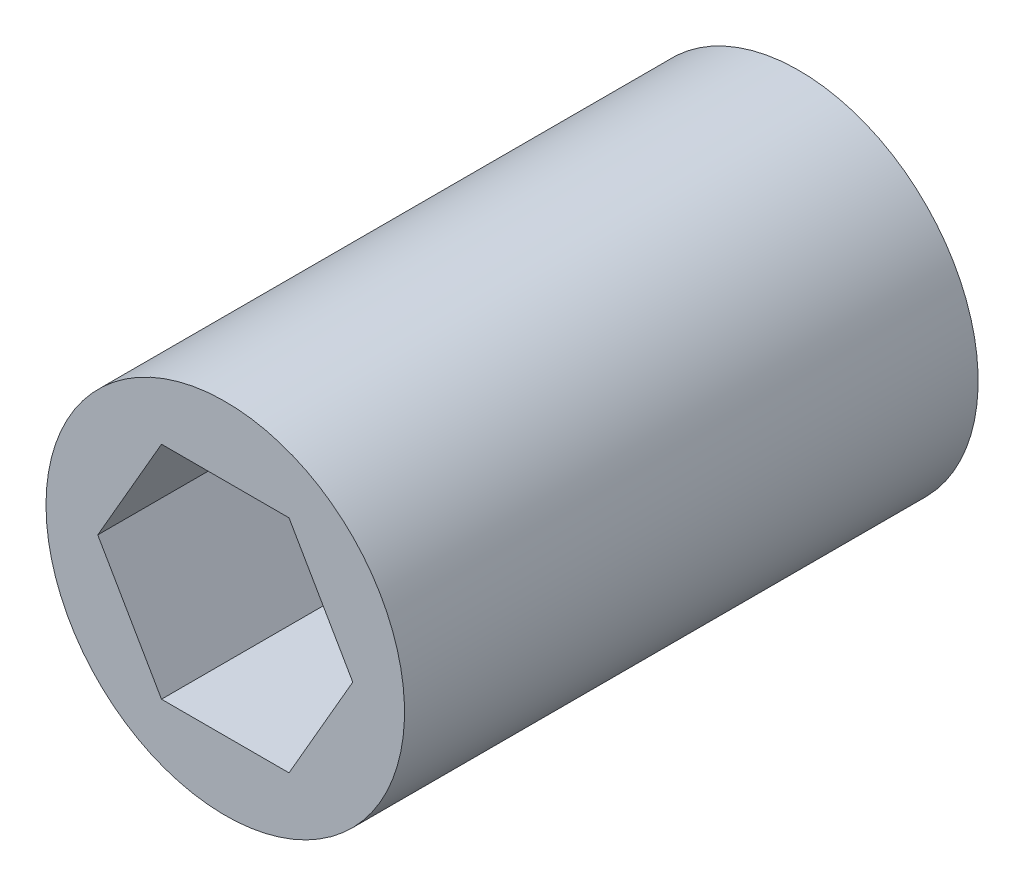
ISO-10303-21;
HEADER;
FILE_DESCRIPTION(('STEP AP214'),'2;1');
FILE_NAME('part.step','',(''),(''),'','','');
FILE_SCHEMA(('AUTOMOTIVE_DESIGN { 1 0 10303 214 1 1 1 1 }'));
ENDSEC;
DATA;
#1=APPLICATION_CONTEXT('core data for automotive mechanical design processes');
#2=APPLICATION_PROTOCOL_DEFINITION('international standard','automotive_design',2000,#1);
#3=PRODUCT_CONTEXT('',#1,'mechanical');
#4=PRODUCT('Part','Part','',(#3));
#5=PRODUCT_RELATED_PRODUCT_CATEGORY('part','',(#4));
#6=PRODUCT_DEFINITION_FORMATION('','',#4);
#7=PRODUCT_DEFINITION_CONTEXT('part definition',#1,'design');
#8=PRODUCT_DEFINITION('design','',#6,#7);
#9=PRODUCT_DEFINITION_SHAPE('','',#8);
#10=(LENGTH_UNIT() NAMED_UNIT(*) SI_UNIT(.MILLI.,.METRE.));
#11=(NAMED_UNIT(*) PLANE_ANGLE_UNIT() SI_UNIT($,.RADIAN.));
#12=(NAMED_UNIT(*) SI_UNIT($,.STERADIAN.) SOLID_ANGLE_UNIT());
#13=UNCERTAINTY_MEASURE_WITH_UNIT(LENGTH_MEASURE(1.E-05),#10,'distance_accuracy_value','');
#14=(GEOMETRIC_REPRESENTATION_CONTEXT(3) GLOBAL_UNCERTAINTY_ASSIGNED_CONTEXT((#13)) GLOBAL_UNIT_ASSIGNED_CONTEXT((#10,
#11,#12)) REPRESENTATION_CONTEXT('',''));
#15=CARTESIAN_POINT('',(0.,0.,0.));
#16=DIRECTION('',(0.,0.,1.));
#17=DIRECTION('',(1.,0.,0.));
#18=AXIS2_PLACEMENT_3D('',#15,#16,#17);
#19=CARTESIAN_POINT('',(-5.64590828240535,0.,12.7));
#20=DIRECTION('',(0.866025403784439,0.5,0.));
#21=DIRECTION('',(-0.5,0.866025403784439,0.));
#22=AXIS2_PLACEMENT_3D('',#19,#20,#21);
#23=PLANE('',#22);
#24=DIRECTION('',(-0.5,0.866025403784439,0.));
#25=VECTOR('',#24,1.);
#26=CARTESIAN_POINT('',(-2.82295414120268,-4.8895,12.7));
#27=LINE('',#26,#25);
#28=CARTESIAN_POINT('',(-2.82295414120268,-4.8895,12.7));
#29=VERTEX_POINT('',#28);
#30=CARTESIAN_POINT('',(-5.64590828240535,0.,12.7));
#31=VERTEX_POINT('',#30);
#32=EDGE_CURVE('E82',#29,#31,#27,.T.);
#33=ORIENTED_EDGE('',*,*,#32,.F.);
#34=DIRECTION('',(0.,0.,1.));
#35=VECTOR('',#34,1.);
#36=CARTESIAN_POINT('',(-2.82295414120268,-4.8895,12.7));
#37=LINE('',#36,#35);
#38=CARTESIAN_POINT('',(-2.82295414120268,-4.8895,-12.7));
#39=VERTEX_POINT('',#38);
#40=EDGE_CURVE('E74',#39,#29,#37,.T.);
#41=ORIENTED_EDGE('',*,*,#40,.F.);
#42=DIRECTION('',(-0.5,0.866025403784439,0.));
#43=VECTOR('',#42,1.);
#44=CARTESIAN_POINT('',(-2.82295414120268,-4.8895,-12.7));
#45=LINE('',#44,#43);
#46=CARTESIAN_POINT('',(-5.64590828240535,0.,-12.7));
#47=VERTEX_POINT('',#46);
#48=EDGE_CURVE('E114',#39,#47,#45,.T.);
#49=ORIENTED_EDGE('',*,*,#48,.T.);
#50=DIRECTION('',(0.,0.,1.));
#51=VECTOR('',#50,1.);
#52=CARTESIAN_POINT('',(-5.64590828240535,0.,12.7));
#53=LINE('',#52,#51);
#54=EDGE_CURVE('E99',#31,#47,#53,.F.);
#55=ORIENTED_EDGE('',*,*,#54,.F.);
#56=EDGE_LOOP('',(#33,#41,#49,#55));
#57=FACE_BOUND('',#56,.T.);
#58=ADVANCED_FACE('F15',(#57),#23,.T.);
#59=CARTESIAN_POINT('',(-2.82295414120268,4.8895,12.7));
#60=DIRECTION('',(0.866025403784439,-0.5,0.));
#61=DIRECTION('',(0.5,0.866025403784439,0.));
#62=AXIS2_PLACEMENT_3D('',#59,#60,#61);
#63=PLANE('',#62);
#64=DIRECTION('',(0.5,0.866025403784439,0.));
#65=VECTOR('',#64,1.);
#66=CARTESIAN_POINT('',(-5.64590828240535,0.,12.7));
#67=LINE('',#66,#65);
#68=CARTESIAN_POINT('',(-2.82295414120268,4.8895,12.7));
#69=VERTEX_POINT('',#68);
#70=EDGE_CURVE('E107',#31,#69,#67,.T.);
#71=ORIENTED_EDGE('',*,*,#70,.F.);
#72=ORIENTED_EDGE('',*,*,#54,.T.);
#73=DIRECTION('',(0.5,0.866025403784439,0.));
#74=VECTOR('',#73,1.);
#75=CARTESIAN_POINT('',(-5.64590828240535,0.,-12.7));
#76=LINE('',#75,#74);
#77=CARTESIAN_POINT('',(-2.82295414120268,4.8895,-12.7));
#78=VERTEX_POINT('',#77);
#79=EDGE_CURVE('E105',#47,#78,#76,.T.);
#80=ORIENTED_EDGE('',*,*,#79,.T.);
#81=DIRECTION('',(0.,0.,1.));
#82=VECTOR('',#81,1.);
#83=CARTESIAN_POINT('',(-2.82295414120268,4.8895,12.7));
#84=LINE('',#83,#82);
#85=EDGE_CURVE('E96',#69,#78,#84,.F.);
#86=ORIENTED_EDGE('',*,*,#85,.F.);
#87=EDGE_LOOP('',(#71,#72,#80,#86));
#88=FACE_BOUND('',#87,.T.);
#89=ADVANCED_FACE('F104',(#88),#63,.T.);
#90=CARTESIAN_POINT('',(2.82295414120267,4.8895,12.7));
#91=DIRECTION('',(0.,-1.,0.));
#92=DIRECTION('',(1.,0.,0.));
#93=AXIS2_PLACEMENT_3D('',#90,#91,#92);
#94=PLANE('',#93);
#95=DIRECTION('',(1.,0.,0.));
#96=VECTOR('',#95,1.);
#97=CARTESIAN_POINT('',(0.,4.8895,12.7));
#98=LINE('',#97,#96);
#99=CARTESIAN_POINT('',(2.82295414120267,4.8895,12.7));
#100=VERTEX_POINT('',#99);
#101=EDGE_CURVE('E124',#69,#100,#98,.T.);
#102=ORIENTED_EDGE('',*,*,#101,.F.);
#103=ORIENTED_EDGE('',*,*,#85,.T.);
#104=DIRECTION('',(1.,0.,0.));
#105=VECTOR('',#104,1.);
#106=CARTESIAN_POINT('',(0.,4.8895,-12.7));
#107=LINE('',#106,#105);
#108=CARTESIAN_POINT('',(2.82295414120267,4.8895,-12.7));
#109=VERTEX_POINT('',#108);
#110=EDGE_CURVE('E116',#78,#109,#107,.T.);
#111=ORIENTED_EDGE('',*,*,#110,.T.);
#112=DIRECTION('',(0.,0.,1.));
#113=VECTOR('',#112,1.);
#114=CARTESIAN_POINT('',(2.82295414120267,4.8895,12.7));
#115=LINE('',#114,#113);
#116=EDGE_CURVE('E93',#100,#109,#115,.F.);
#117=ORIENTED_EDGE('',*,*,#116,.F.);
#118=EDGE_LOOP('',(#102,#103,#111,#117));
#119=FACE_BOUND('',#118,.T.);
#120=ADVANCED_FACE('F133',(#119),#94,.T.);
#121=CARTESIAN_POINT('',(5.64590828240535,0.,12.7));
#122=DIRECTION('',(-0.866025403784438,-0.500000000000001,0.));
#123=DIRECTION('',(0.500000000000001,-0.866025403784438,0.));
#124=AXIS2_PLACEMENT_3D('',#121,#122,#123);
#125=PLANE('',#124);
#126=DIRECTION('',(0.5,-0.866025403784438,0.));
#127=VECTOR('',#126,1.);
#128=CARTESIAN_POINT('',(2.82295414120267,4.8895,12.7));
#129=LINE('',#128,#127);
#130=CARTESIAN_POINT('',(5.64590828240535,0.,12.7));
#131=VERTEX_POINT('',#130);
#132=EDGE_CURVE('E87',#100,#131,#129,.T.);
#133=ORIENTED_EDGE('',*,*,#132,.F.);
#134=ORIENTED_EDGE('',*,*,#116,.T.);
#135=DIRECTION('',(0.5,-0.866025403784438,0.));
#136=VECTOR('',#135,1.);
#137=CARTESIAN_POINT('',(2.82295414120267,4.8895,-12.7));
#138=LINE('',#137,#136);
#139=CARTESIAN_POINT('',(5.64590828240535,0.,-12.7));
#140=VERTEX_POINT('',#139);
#141=EDGE_CURVE('E118',#109,#140,#138,.T.);
#142=ORIENTED_EDGE('',*,*,#141,.T.);
#143=DIRECTION('',(0.,0.,1.));
#144=VECTOR('',#143,1.);
#145=CARTESIAN_POINT('',(5.64590828240535,0.,12.7));
#146=LINE('',#145,#144);
#147=EDGE_CURVE('E63',#131,#140,#146,.F.);
#148=ORIENTED_EDGE('',*,*,#147,.F.);
#149=EDGE_LOOP('',(#133,#134,#142,#148));
#150=FACE_BOUND('',#149,.T.);
#151=ADVANCED_FACE('F130',(#150),#125,.T.);
#152=CARTESIAN_POINT('',(2.82295414120268,-4.8895,12.7));
#153=DIRECTION('',(-0.866025403784439,0.5,0.));
#154=DIRECTION('',(-0.5,-0.866025403784439,0.));
#155=AXIS2_PLACEMENT_3D('',#152,#153,#154);
#156=PLANE('',#155);
#157=DIRECTION('',(-0.5,-0.866025403784439,0.));
#158=VECTOR('',#157,1.);
#159=CARTESIAN_POINT('',(5.64590828240535,0.,12.7));
#160=LINE('',#159,#158);
#161=CARTESIAN_POINT('',(2.82295414120268,-4.8895,12.7));
#162=VERTEX_POINT('',#161);
#163=EDGE_CURVE('E69',#131,#162,#160,.T.);
#164=ORIENTED_EDGE('',*,*,#163,.F.);
#165=ORIENTED_EDGE('',*,*,#147,.T.);
#166=DIRECTION('',(-0.5,-0.866025403784439,0.));
#167=VECTOR('',#166,1.);
#168=CARTESIAN_POINT('',(5.64590828240535,0.,-12.7));
#169=LINE('',#168,#167);
#170=CARTESIAN_POINT('',(2.82295414120268,-4.8895,-12.7));
#171=VERTEX_POINT('',#170);
#172=EDGE_CURVE('E31',#140,#171,#169,.T.);
#173=ORIENTED_EDGE('',*,*,#172,.T.);
#174=DIRECTION('',(0.,0.,1.));
#175=VECTOR('',#174,1.);
#176=CARTESIAN_POINT('',(2.82295414120268,-4.8895,12.7));
#177=LINE('',#176,#175);
#178=EDGE_CURVE('E65',#162,#171,#177,.F.);
#179=ORIENTED_EDGE('',*,*,#178,.F.);
#180=EDGE_LOOP('',(#164,#165,#173,#179));
#181=FACE_BOUND('',#180,.T.);
#182=ADVANCED_FACE('F67',(#181),#156,.T.);
#183=CARTESIAN_POINT('',(-2.82295414120268,-4.8895,12.7));
#184=DIRECTION('',(0.,1.,0.));
#185=DIRECTION('',(-1.,0.,0.));
#186=AXIS2_PLACEMENT_3D('',#183,#184,#185);
#187=PLANE('',#186);
#188=DIRECTION('',(1.,0.,0.));
#189=VECTOR('',#188,1.);
#190=CARTESIAN_POINT('',(0.,-4.8895,12.7));
#191=LINE('',#190,#189);
#192=EDGE_CURVE('E77',#162,#29,#191,.F.);
#193=ORIENTED_EDGE('',*,*,#192,.F.);
#194=ORIENTED_EDGE('',*,*,#178,.T.);
#195=DIRECTION('',(1.,0.,0.));
#196=VECTOR('',#195,1.);
#197=CARTESIAN_POINT('',(0.,-4.8895,-12.7));
#198=LINE('',#197,#196);
#199=EDGE_CURVE('E126',#171,#39,#198,.F.);
#200=ORIENTED_EDGE('',*,*,#199,.T.);
#201=ORIENTED_EDGE('',*,*,#40,.T.);
#202=EDGE_LOOP('',(#193,#194,#200,#201));
#203=FACE_BOUND('',#202,.T.);
#204=ADVANCED_FACE('F78',(#203),#187,.T.);
#205=CARTESIAN_POINT('',(0.,0.,12.7));
#206=DIRECTION('',(0.,0.,1.));
#207=DIRECTION('',(1.,0.,0.));
#208=AXIS2_PLACEMENT_3D('',#205,#206,#207);
#209=PLANE('',#208);
#210=ORIENTED_EDGE('',*,*,#101,.T.);
#211=ORIENTED_EDGE('',*,*,#132,.T.);
#212=ORIENTED_EDGE('',*,*,#163,.T.);
#213=ORIENTED_EDGE('',*,*,#192,.T.);
#214=ORIENTED_EDGE('',*,*,#32,.T.);
#215=ORIENTED_EDGE('',*,*,#70,.T.);
#216=EDGE_LOOP('',(#210,#211,#212,#213,#214,#215));
#217=FACE_BOUND('',#216,.T.);
#218=CARTESIAN_POINT('',(0.,0.,12.7));
#219=DIRECTION('',(0.,0.,-1.));
#220=DIRECTION('',(-1.,0.,0.));
#221=AXIS2_PLACEMENT_3D('',#218,#219,#220);
#222=CIRCLE('',#221,7.9375);
#223=CARTESIAN_POINT('',(-7.9375,0.,12.7));
#224=VERTEX_POINT('',#223);
#225=EDGE_CURVE('E18',#224,#224,#222,.T.);
#226=ORIENTED_EDGE('',*,*,#225,.F.);
#227=EDGE_LOOP('',(#226));
#228=FACE_BOUND('',#227,.T.);
#229=ADVANCED_FACE('F85',(#217,#228),#209,.T.);
#230=CARTESIAN_POINT('',(0.,0.,-12.7));
#231=DIRECTION('',(0.,0.,1.));
#232=DIRECTION('',(1.,0.,0.));
#233=AXIS2_PLACEMENT_3D('',#230,#231,#232);
#234=PLANE('',#233);
#235=ORIENTED_EDGE('',*,*,#172,.F.);
#236=ORIENTED_EDGE('',*,*,#141,.F.);
#237=ORIENTED_EDGE('',*,*,#110,.F.);
#238=ORIENTED_EDGE('',*,*,#79,.F.);
#239=ORIENTED_EDGE('',*,*,#48,.F.);
#240=ORIENTED_EDGE('',*,*,#199,.F.);
#241=EDGE_LOOP('',(#235,#236,#237,#238,#239,#240));
#242=FACE_BOUND('',#241,.T.);
#243=CARTESIAN_POINT('',(0.,0.,-12.7));
#244=DIRECTION('',(0.,0.,-1.));
#245=DIRECTION('',(-1.,0.,0.));
#246=AXIS2_PLACEMENT_3D('',#243,#244,#245);
#247=CIRCLE('',#246,7.9375);
#248=CARTESIAN_POINT('',(-7.9375,0.,-12.7));
#249=VERTEX_POINT('',#248);
#250=EDGE_CURVE('E10',#249,#249,#247,.F.);
#251=ORIENTED_EDGE('',*,*,#250,.F.);
#252=EDGE_LOOP('',(#251));
#253=FACE_BOUND('',#252,.T.);
#254=ADVANCED_FACE('F112',(#242,#253),#234,.F.);
#255=CARTESIAN_POINT('',(0.,0.,12.7));
#256=DIRECTION('',(0.,0.,-1.));
#257=DIRECTION('',(-1.,0.,0.));
#258=AXIS2_PLACEMENT_3D('',#255,#256,#257);
#259=CYLINDRICAL_SURFACE('',#258,7.9375);
#260=ORIENTED_EDGE('',*,*,#250,.T.);
#261=EDGE_LOOP('',(#260));
#262=FACE_BOUND('',#261,.T.);
#263=ORIENTED_EDGE('',*,*,#225,.T.);
#264=EDGE_LOOP('',(#263));
#265=FACE_BOUND('',#264,.T.);
#266=ADVANCED_FACE('F141',(#262,#265),#259,.T.);
#267=CLOSED_SHELL('',(#58,#89,#120,#151,#182,#204,#229,#254,#266));
#268=MANIFOLD_SOLID_BREP('B1',#267);
#269=ADVANCED_BREP_SHAPE_REPRESENTATION('',(#18,#268),#14);
#270=SHAPE_DEFINITION_REPRESENTATION(#9,#269);
ENDSEC;
END-ISO-10303-21;
